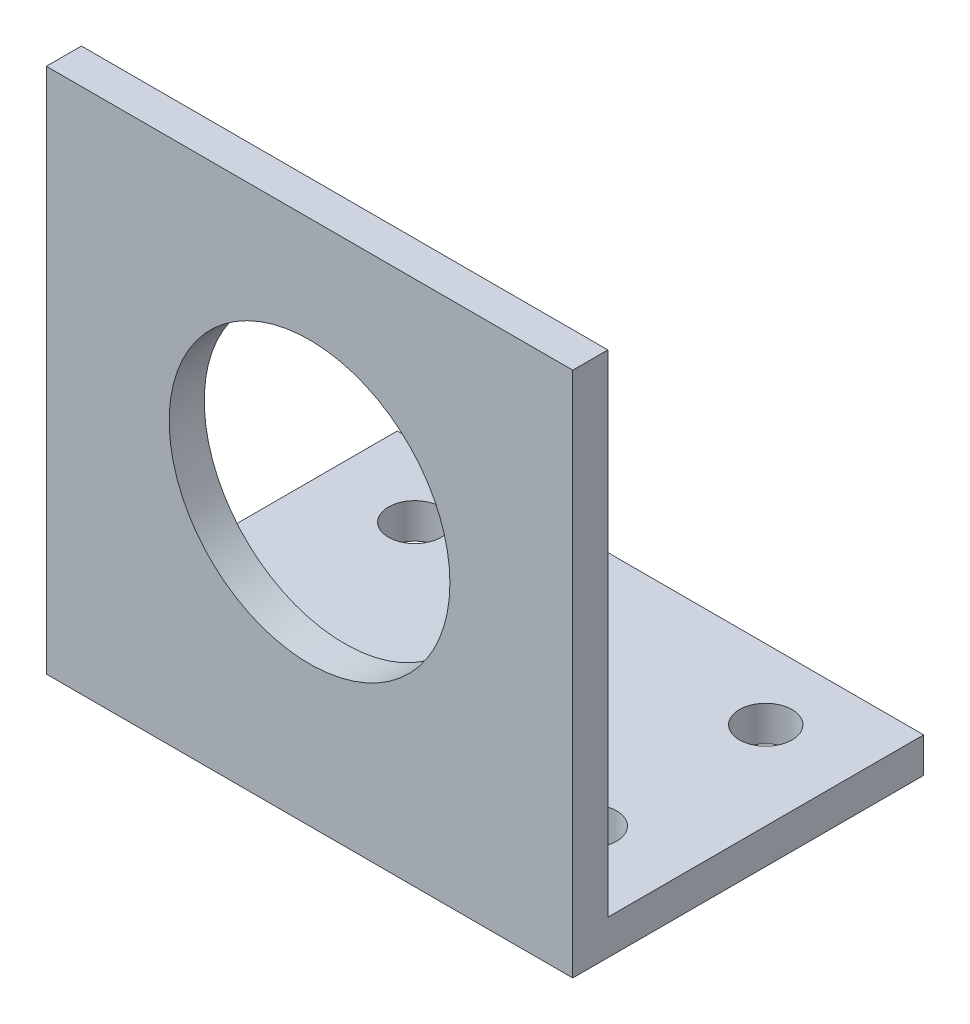
ISO-10303-21;
HEADER;
FILE_DESCRIPTION(('STEP AP214'),'2;1');
FILE_NAME('part.step','',(''),(''),'','','');
FILE_SCHEMA(('AUTOMOTIVE_DESIGN { 1 0 10303 214 1 1 1 1 }'));
ENDSEC;
DATA;
#1=APPLICATION_CONTEXT('core data for automotive mechanical design processes');
#2=APPLICATION_PROTOCOL_DEFINITION('international standard','automotive_design',2000,#1);
#3=PRODUCT_CONTEXT('',#1,'mechanical');
#4=PRODUCT('Part','Part','',(#3));
#5=PRODUCT_RELATED_PRODUCT_CATEGORY('part','',(#4));
#6=PRODUCT_DEFINITION_FORMATION('','',#4);
#7=PRODUCT_DEFINITION_CONTEXT('part definition',#1,'design');
#8=PRODUCT_DEFINITION('design','',#6,#7);
#9=PRODUCT_DEFINITION_SHAPE('','',#8);
#10=(LENGTH_UNIT() NAMED_UNIT(*) SI_UNIT(.MILLI.,.METRE.));
#11=(NAMED_UNIT(*) PLANE_ANGLE_UNIT() SI_UNIT($,.RADIAN.));
#12=(NAMED_UNIT(*) SI_UNIT($,.STERADIAN.) SOLID_ANGLE_UNIT());
#13=UNCERTAINTY_MEASURE_WITH_UNIT(LENGTH_MEASURE(1.E-05),#10,'distance_accuracy_value','');
#14=(GEOMETRIC_REPRESENTATION_CONTEXT(3) GLOBAL_UNCERTAINTY_ASSIGNED_CONTEXT((#13)) GLOBAL_UNIT_ASSIGNED_CONTEXT((#10,
#11,#12)) REPRESENTATION_CONTEXT('',''));
#15=CARTESIAN_POINT('',(0.,0.,0.));
#16=DIRECTION('',(0.,0.,1.));
#17=DIRECTION('',(1.,0.,0.));
#18=AXIS2_PLACEMENT_3D('',#15,#16,#17);
#19=CARTESIAN_POINT('',(0.,0.,-20.));
#20=DIRECTION('',(0.,0.,-1.));
#21=DIRECTION('',(-1.,0.,0.));
#22=AXIS2_PLACEMENT_3D('',#19,#20,#21);
#23=PLANE('',#22);
#24=DIRECTION('',(0.,1.,0.));
#25=VECTOR('',#24,1.);
#26=CARTESIAN_POINT('',(-5.,3.,-20.));
#27=LINE('',#26,#25);
#28=CARTESIAN_POINT('',(-5.,0.,-20.));
#29=VERTEX_POINT('',#28);
#30=CARTESIAN_POINT('',(-5.,2.,-20.));
#31=VERTEX_POINT('',#30);
#32=EDGE_CURVE('E121',#29,#31,#27,.T.);
#33=ORIENTED_EDGE('',*,*,#32,.T.);
#34=DIRECTION('',(-1.,0.,0.));
#35=VECTOR('',#34,1.);
#36=CARTESIAN_POINT('',(-5.,2.,-20.));
#37=LINE('',#36,#35);
#38=CARTESIAN_POINT('',(25.,2.,-20.));
#39=VERTEX_POINT('',#38);
#40=EDGE_CURVE('E115',#39,#31,#37,.T.);
#41=ORIENTED_EDGE('',*,*,#40,.F.);
#42=DIRECTION('',(0.,-1.,0.));
#43=VECTOR('',#42,1.);
#44=CARTESIAN_POINT('',(25.,3.,-20.));
#45=LINE('',#44,#43);
#46=CARTESIAN_POINT('',(25.,0.,-20.));
#47=VERTEX_POINT('',#46);
#48=EDGE_CURVE('E117',#39,#47,#45,.T.);
#49=ORIENTED_EDGE('',*,*,#48,.T.);
#50=DIRECTION('',(-1.,0.,0.));
#51=VECTOR('',#50,1.);
#52=CARTESIAN_POINT('',(25.,0.,-20.));
#53=LINE('',#52,#51);
#54=EDGE_CURVE('E119',#47,#29,#53,.T.);
#55=ORIENTED_EDGE('',*,*,#54,.T.);
#56=EDGE_LOOP('',(#33,#41,#49,#55));
#57=FACE_BOUND('',#56,.T.);
#58=ADVANCED_FACE('F35',(#57),#23,.T.);
#59=CARTESIAN_POINT('',(20.,0.,-38.));
#60=DIRECTION('',(0.,1.,0.));
#61=DIRECTION('',(0.,0.,1.));
#62=AXIS2_PLACEMENT_3D('',#59,#60,#61);
#63=PLANE('',#62);
#64=CARTESIAN_POINT('',(20.,0.,-16.));
#65=DIRECTION('',(0.,1.,0.));
#66=DIRECTION('',(0.,0.,1.));
#67=AXIS2_PLACEMENT_3D('',#64,#65,#66);
#68=CIRCLE('',#67,1.5);
#69=CARTESIAN_POINT('',(20.,0.,-14.5));
#70=VERTEX_POINT('',#69);
#71=EDGE_CURVE('E148',#70,#70,#68,.T.);
#72=ORIENTED_EDGE('',*,*,#71,.T.);
#73=EDGE_LOOP('',(#72));
#74=FACE_BOUND('',#73,.T.);
#75=CARTESIAN_POINT('',(0.,0.,-16.));
#76=DIRECTION('',(0.,1.,0.));
#77=DIRECTION('',(0.,0.,1.));
#78=AXIS2_PLACEMENT_3D('',#75,#76,#77);
#79=CIRCLE('',#78,1.5);
#80=CARTESIAN_POINT('',(0.,0.,-14.5));
#81=VERTEX_POINT('',#80);
#82=EDGE_CURVE('E159',#81,#81,#79,.T.);
#83=ORIENTED_EDGE('',*,*,#82,.T.);
#84=EDGE_LOOP('',(#83));
#85=FACE_BOUND('',#84,.T.);
#86=CARTESIAN_POINT('',(0.,0.,-6.));
#87=DIRECTION('',(0.,1.,0.));
#88=DIRECTION('',(0.,0.,1.));
#89=AXIS2_PLACEMENT_3D('',#86,#87,#88);
#90=CIRCLE('',#89,1.5);
#91=CARTESIAN_POINT('',(0.,0.,-4.5));
#92=VERTEX_POINT('',#91);
#93=EDGE_CURVE('E152',#92,#92,#90,.T.);
#94=ORIENTED_EDGE('',*,*,#93,.T.);
#95=EDGE_LOOP('',(#94));
#96=FACE_BOUND('',#95,.T.);
#97=CARTESIAN_POINT('',(20.,0.,-6.));
#98=DIRECTION('',(0.,1.,0.));
#99=DIRECTION('',(0.,0.,1.));
#100=AXIS2_PLACEMENT_3D('',#97,#98,#99);
#101=CIRCLE('',#100,1.5);
#102=CARTESIAN_POINT('',(20.,0.,-4.5));
#103=VERTEX_POINT('',#102);
#104=EDGE_CURVE('E167',#103,#103,#101,.T.);
#105=ORIENTED_EDGE('',*,*,#104,.T.);
#106=EDGE_LOOP('',(#105));
#107=FACE_BOUND('',#106,.T.);
#108=ORIENTED_EDGE('',*,*,#54,.F.);
#109=DIRECTION('',(0.,0.,-1.));
#110=VECTOR('',#109,1.);
#111=CARTESIAN_POINT('',(25.,0.,0.));
#112=LINE('',#111,#110);
#113=CARTESIAN_POINT('',(25.,0.,0.));
#114=VERTEX_POINT('',#113);
#115=EDGE_CURVE('E132',#114,#47,#112,.T.);
#116=ORIENTED_EDGE('',*,*,#115,.F.);
#117=DIRECTION('',(-1.,0.,0.));
#118=VECTOR('',#117,1.);
#119=CARTESIAN_POINT('',(20.,0.,0.));
#120=LINE('',#119,#118);
#121=CARTESIAN_POINT('',(-5.,0.,0.));
#122=VERTEX_POINT('',#121);
#123=EDGE_CURVE('E43',#114,#122,#120,.T.);
#124=ORIENTED_EDGE('',*,*,#123,.T.);
#125=DIRECTION('',(0.,0.,1.));
#126=VECTOR('',#125,1.);
#127=CARTESIAN_POINT('',(-5.,0.,0.));
#128=LINE('',#127,#126);
#129=EDGE_CURVE('E127',#29,#122,#128,.T.);
#130=ORIENTED_EDGE('',*,*,#129,.F.);
#131=EDGE_LOOP('',(#108,#116,#124,#130));
#132=FACE_BOUND('',#131,.T.);
#133=ADVANCED_FACE('F37',(#74,#85,#96,#107,#132),#63,.F.);
#134=CARTESIAN_POINT('',(25.,0.,0.));
#135=DIRECTION('',(1.,0.,0.));
#136=DIRECTION('',(0.,0.,-1.));
#137=AXIS2_PLACEMENT_3D('',#134,#135,#136);
#138=PLANE('',#137);
#139=DIRECTION('',(0.,0.,-1.));
#140=VECTOR('',#139,1.);
#141=CARTESIAN_POINT('',(25.,30.,0.));
#142=LINE('',#141,#140);
#143=CARTESIAN_POINT('',(25.,30.,0.));
#144=VERTEX_POINT('',#143);
#145=CARTESIAN_POINT('',(25.,30.,-2.));
#146=VERTEX_POINT('',#145);
#147=EDGE_CURVE('E50',#144,#146,#142,.T.);
#148=ORIENTED_EDGE('',*,*,#147,.F.);
#149=DIRECTION('',(0.,-1.,0.));
#150=VECTOR('',#149,1.);
#151=CARTESIAN_POINT('',(25.,0.,0.));
#152=LINE('',#151,#150);
#153=EDGE_CURVE('E130',#144,#114,#152,.T.);
#154=ORIENTED_EDGE('',*,*,#153,.T.);
#155=ORIENTED_EDGE('',*,*,#115,.T.);
#156=ORIENTED_EDGE('',*,*,#48,.F.);
#157=DIRECTION('',(0.,0.,-1.));
#158=VECTOR('',#157,1.);
#159=CARTESIAN_POINT('',(25.,2.,-20.));
#160=LINE('',#159,#158);
#161=CARTESIAN_POINT('',(25.,2.,-2.));
#162=VERTEX_POINT('',#161);
#163=EDGE_CURVE('E57',#162,#39,#160,.T.);
#164=ORIENTED_EDGE('',*,*,#163,.F.);
#165=DIRECTION('',(0.,-1.,0.));
#166=VECTOR('',#165,1.);
#167=CARTESIAN_POINT('',(25.,2.,-2.));
#168=LINE('',#167,#166);
#169=EDGE_CURVE('E109',#146,#162,#168,.T.);
#170=ORIENTED_EDGE('',*,*,#169,.F.);
#171=EDGE_LOOP('',(#148,#154,#155,#156,#164,#170));
#172=FACE_BOUND('',#171,.T.);
#173=ADVANCED_FACE('F173',(#172),#138,.T.);
#174=CARTESIAN_POINT('',(-5.,0.,0.));
#175=DIRECTION('',(-1.,0.,0.));
#176=DIRECTION('',(0.,0.,1.));
#177=AXIS2_PLACEMENT_3D('',#174,#175,#176);
#178=PLANE('',#177);
#179=DIRECTION('',(0.,0.,1.));
#180=VECTOR('',#179,1.);
#181=CARTESIAN_POINT('',(-5.,30.,0.));
#182=LINE('',#181,#180);
#183=CARTESIAN_POINT('',(-5.,30.,-2.));
#184=VERTEX_POINT('',#183);
#185=CARTESIAN_POINT('',(-5.,30.,0.));
#186=VERTEX_POINT('',#185);
#187=EDGE_CURVE('E87',#184,#186,#182,.T.);
#188=ORIENTED_EDGE('',*,*,#187,.F.);
#189=DIRECTION('',(0.,1.,0.));
#190=VECTOR('',#189,1.);
#191=CARTESIAN_POINT('',(-5.,2.,-2.));
#192=LINE('',#191,#190);
#193=CARTESIAN_POINT('',(-5.,2.,-2.));
#194=VERTEX_POINT('',#193);
#195=EDGE_CURVE('E97',#194,#184,#192,.T.);
#196=ORIENTED_EDGE('',*,*,#195,.F.);
#197=DIRECTION('',(0.,0.,1.));
#198=VECTOR('',#197,1.);
#199=CARTESIAN_POINT('',(-5.,2.,-20.));
#200=LINE('',#199,#198);
#201=EDGE_CURVE('E108',#31,#194,#200,.T.);
#202=ORIENTED_EDGE('',*,*,#201,.F.);
#203=ORIENTED_EDGE('',*,*,#32,.F.);
#204=ORIENTED_EDGE('',*,*,#129,.T.);
#205=DIRECTION('',(0.,1.,0.));
#206=VECTOR('',#205,1.);
#207=CARTESIAN_POINT('',(-5.,0.,0.));
#208=LINE('',#207,#206);
#209=EDGE_CURVE('E99',#122,#186,#208,.T.);
#210=ORIENTED_EDGE('',*,*,#209,.T.);
#211=EDGE_LOOP('',(#188,#196,#202,#203,#204,#210));
#212=FACE_BOUND('',#211,.T.);
#213=ADVANCED_FACE('F95',(#212),#178,.T.);
#214=CARTESIAN_POINT('',(20.,0.,0.));
#215=DIRECTION('',(0.,0.,-1.));
#216=DIRECTION('',(-1.,0.,0.));
#217=AXIS2_PLACEMENT_3D('',#214,#215,#216);
#218=PLANE('',#217);
#219=CARTESIAN_POINT('',(10.,16.,0.));
#220=DIRECTION('',(0.,0.,1.));
#221=DIRECTION('',(1.,0.,0.));
#222=AXIS2_PLACEMENT_3D('',#219,#220,#221);
#223=CIRCLE('',#222,8.);
#224=CARTESIAN_POINT('',(18.,16.,0.));
#225=VERTEX_POINT('',#224);
#226=EDGE_CURVE('E124',#225,#225,#223,.T.);
#227=ORIENTED_EDGE('',*,*,#226,.F.);
#228=EDGE_LOOP('',(#227));
#229=FACE_BOUND('',#228,.T.);
#230=ORIENTED_EDGE('',*,*,#153,.F.);
#231=DIRECTION('',(-1.,0.,0.));
#232=VECTOR('',#231,1.);
#233=CARTESIAN_POINT('',(20.,30.,0.));
#234=LINE('',#233,#232);
#235=EDGE_CURVE('E144',#144,#186,#234,.T.);
#236=ORIENTED_EDGE('',*,*,#235,.T.);
#237=ORIENTED_EDGE('',*,*,#209,.F.);
#238=ORIENTED_EDGE('',*,*,#123,.F.);
#239=EDGE_LOOP('',(#230,#236,#237,#238));
#240=FACE_BOUND('',#239,.T.);
#241=ADVANCED_FACE('F143',(#229,#240),#218,.F.);
#242=CARTESIAN_POINT('',(10.,16.,-8.));
#243=DIRECTION('',(0.,0.,1.));
#244=DIRECTION('',(1.,0.,0.));
#245=AXIS2_PLACEMENT_3D('',#242,#243,#244);
#246=CYLINDRICAL_SURFACE('',#245,8.);
#247=CARTESIAN_POINT('',(10.,16.,-2.));
#248=DIRECTION('',(0.,0.,1.));
#249=DIRECTION('',(1.,0.,0.));
#250=AXIS2_PLACEMENT_3D('',#247,#248,#249);
#251=CIRCLE('',#250,8.);
#252=CARTESIAN_POINT('',(18.,16.,-2.));
#253=VERTEX_POINT('',#252);
#254=EDGE_CURVE('E105',#253,#253,#251,.F.);
#255=ORIENTED_EDGE('',*,*,#254,.T.);
#256=EDGE_LOOP('',(#255));
#257=FACE_BOUND('',#256,.T.);
#258=ORIENTED_EDGE('',*,*,#226,.T.);
#259=EDGE_LOOP('',(#258));
#260=FACE_BOUND('',#259,.T.);
#261=ADVANCED_FACE('F186',(#257,#260),#246,.F.);
#262=CARTESIAN_POINT('',(0.,2.,0.));
#263=DIRECTION('',(0.,1.,0.));
#264=DIRECTION('',(0.,0.,1.));
#265=AXIS2_PLACEMENT_3D('',#262,#263,#264);
#266=PLANE('',#265);
#267=CARTESIAN_POINT('',(20.,2.,-16.));
#268=DIRECTION('',(0.,1.,0.));
#269=DIRECTION('',(0.,0.,1.));
#270=AXIS2_PLACEMENT_3D('',#267,#268,#269);
#271=CIRCLE('',#270,1.5);
#272=CARTESIAN_POINT('',(20.,2.,-14.5));
#273=VERTEX_POINT('',#272);
#274=EDGE_CURVE('E145',#273,#273,#271,.T.);
#275=ORIENTED_EDGE('',*,*,#274,.F.);
#276=EDGE_LOOP('',(#275));
#277=FACE_BOUND('',#276,.T.);
#278=CARTESIAN_POINT('',(0.,2.,-16.));
#279=DIRECTION('',(0.,1.,0.));
#280=DIRECTION('',(0.,0.,1.));
#281=AXIS2_PLACEMENT_3D('',#278,#279,#280);
#282=CIRCLE('',#281,1.5);
#283=CARTESIAN_POINT('',(0.,2.,-14.5));
#284=VERTEX_POINT('',#283);
#285=EDGE_CURVE('E162',#284,#284,#282,.T.);
#286=ORIENTED_EDGE('',*,*,#285,.F.);
#287=EDGE_LOOP('',(#286));
#288=FACE_BOUND('',#287,.T.);
#289=CARTESIAN_POINT('',(0.,2.,-6.));
#290=DIRECTION('',(0.,1.,0.));
#291=DIRECTION('',(0.,0.,1.));
#292=AXIS2_PLACEMENT_3D('',#289,#290,#291);
#293=CIRCLE('',#292,1.5);
#294=CARTESIAN_POINT('',(0.,2.,-4.5));
#295=VERTEX_POINT('',#294);
#296=EDGE_CURVE('E156',#295,#295,#293,.T.);
#297=ORIENTED_EDGE('',*,*,#296,.F.);
#298=EDGE_LOOP('',(#297));
#299=FACE_BOUND('',#298,.T.);
#300=CARTESIAN_POINT('',(20.,2.,-6.));
#301=DIRECTION('',(0.,1.,0.));
#302=DIRECTION('',(0.,0.,1.));
#303=AXIS2_PLACEMENT_3D('',#300,#301,#302);
#304=CIRCLE('',#303,1.5);
#305=CARTESIAN_POINT('',(20.,2.,-4.5));
#306=VERTEX_POINT('',#305);
#307=EDGE_CURVE('E155',#306,#306,#304,.T.);
#308=ORIENTED_EDGE('',*,*,#307,.F.);
#309=EDGE_LOOP('',(#308));
#310=FACE_BOUND('',#309,.T.);
#311=ORIENTED_EDGE('',*,*,#201,.T.);
#312=DIRECTION('',(-1.,0.,0.));
#313=VECTOR('',#312,1.);
#314=CARTESIAN_POINT('',(25.,2.,-2.));
#315=LINE('',#314,#313);
#316=EDGE_CURVE('E104',#162,#194,#315,.T.);
#317=ORIENTED_EDGE('',*,*,#316,.F.);
#318=ORIENTED_EDGE('',*,*,#163,.T.);
#319=ORIENTED_EDGE('',*,*,#40,.T.);
#320=EDGE_LOOP('',(#311,#317,#318,#319));
#321=FACE_BOUND('',#320,.T.);
#322=ADVANCED_FACE('F174',(#277,#288,#299,#310,#321),#266,.T.);
#323=CARTESIAN_POINT('',(0.,0.,-2.));
#324=DIRECTION('',(0.,0.,1.));
#325=DIRECTION('',(1.,0.,0.));
#326=AXIS2_PLACEMENT_3D('',#323,#324,#325);
#327=PLANE('',#326);
#328=ORIENTED_EDGE('',*,*,#195,.T.);
#329=DIRECTION('',(1.,0.,0.));
#330=VECTOR('',#329,1.);
#331=CARTESIAN_POINT('',(0.,30.,-2.));
#332=LINE('',#331,#330);
#333=EDGE_CURVE('E11',#184,#146,#332,.T.);
#334=ORIENTED_EDGE('',*,*,#333,.T.);
#335=ORIENTED_EDGE('',*,*,#169,.T.);
#336=ORIENTED_EDGE('',*,*,#316,.T.);
#337=EDGE_LOOP('',(#328,#334,#335,#336));
#338=FACE_BOUND('',#337,.T.);
#339=ORIENTED_EDGE('',*,*,#254,.F.);
#340=EDGE_LOOP('',(#339));
#341=FACE_BOUND('',#340,.T.);
#342=ADVANCED_FACE('F102',(#338,#341),#327,.F.);
#343=CARTESIAN_POINT('',(20.,0.,-6.));
#344=DIRECTION('',(0.,1.,0.));
#345=DIRECTION('',(0.,0.,1.));
#346=AXIS2_PLACEMENT_3D('',#343,#344,#345);
#347=CYLINDRICAL_SURFACE('',#346,1.5);
#348=ORIENTED_EDGE('',*,*,#104,.F.);
#349=EDGE_LOOP('',(#348));
#350=FACE_BOUND('',#349,.T.);
#351=ORIENTED_EDGE('',*,*,#307,.T.);
#352=EDGE_LOOP('',(#351));
#353=FACE_BOUND('',#352,.T.);
#354=ADVANCED_FACE('F219',(#350,#353),#347,.F.);
#355=CARTESIAN_POINT('',(0.,0.,-6.));
#356=DIRECTION('',(0.,1.,0.));
#357=DIRECTION('',(0.,0.,1.));
#358=AXIS2_PLACEMENT_3D('',#355,#356,#357);
#359=CYLINDRICAL_SURFACE('',#358,1.5);
#360=ORIENTED_EDGE('',*,*,#93,.F.);
#361=EDGE_LOOP('',(#360));
#362=FACE_BOUND('',#361,.T.);
#363=ORIENTED_EDGE('',*,*,#296,.T.);
#364=EDGE_LOOP('',(#363));
#365=FACE_BOUND('',#364,.T.);
#366=ADVANCED_FACE('F225',(#362,#365),#359,.F.);
#367=CARTESIAN_POINT('',(0.,0.,-16.));
#368=DIRECTION('',(0.,1.,0.));
#369=DIRECTION('',(0.,0.,1.));
#370=AXIS2_PLACEMENT_3D('',#367,#368,#369);
#371=CYLINDRICAL_SURFACE('',#370,1.5);
#372=ORIENTED_EDGE('',*,*,#82,.F.);
#373=EDGE_LOOP('',(#372));
#374=FACE_BOUND('',#373,.T.);
#375=ORIENTED_EDGE('',*,*,#285,.T.);
#376=EDGE_LOOP('',(#375));
#377=FACE_BOUND('',#376,.T.);
#378=ADVANCED_FACE('F233',(#374,#377),#371,.F.);
#379=CARTESIAN_POINT('',(20.,0.,-16.));
#380=DIRECTION('',(0.,1.,0.));
#381=DIRECTION('',(0.,0.,1.));
#382=AXIS2_PLACEMENT_3D('',#379,#380,#381);
#383=CYLINDRICAL_SURFACE('',#382,1.5);
#384=ORIENTED_EDGE('',*,*,#71,.F.);
#385=EDGE_LOOP('',(#384));
#386=FACE_BOUND('',#385,.T.);
#387=ORIENTED_EDGE('',*,*,#274,.T.);
#388=EDGE_LOOP('',(#387));
#389=FACE_BOUND('',#388,.T.);
#390=ADVANCED_FACE('F241',(#386,#389),#383,.F.);
#391=CARTESIAN_POINT('',(0.,30.,0.));
#392=DIRECTION('',(0.,-1.,0.));
#393=DIRECTION('',(0.,0.,-1.));
#394=AXIS2_PLACEMENT_3D('',#391,#392,#393);
#395=PLANE('',#394);
#396=ORIENTED_EDGE('',*,*,#147,.T.);
#397=ORIENTED_EDGE('',*,*,#333,.F.);
#398=ORIENTED_EDGE('',*,*,#187,.T.);
#399=ORIENTED_EDGE('',*,*,#235,.F.);
#400=EDGE_LOOP('',(#396,#397,#398,#399));
#401=FACE_BOUND('',#400,.T.);
#402=ADVANCED_FACE('F86',(#401),#395,.F.);
#403=CLOSED_SHELL('',(#58,#133,#173,#213,#241,#261,#322,#342,#354,#366,#378,#390,#402));
#404=MANIFOLD_SOLID_BREP('B2',#403);
#405=ADVANCED_BREP_SHAPE_REPRESENTATION('',(#18,#404),#14);
#406=SHAPE_DEFINITION_REPRESENTATION(#9,#405);
ENDSEC;
END-ISO-10303-21;
